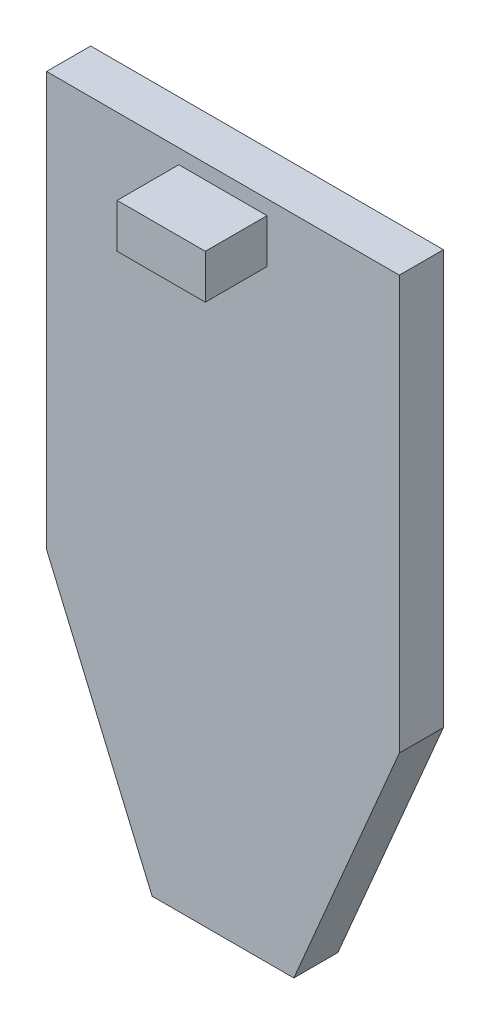
ISO-10303-21;
HEADER;
FILE_DESCRIPTION(('STEP AP214'),'2;1');
FILE_NAME('part.step','',(''),(''),'','','');
FILE_SCHEMA(('AUTOMOTIVE_DESIGN { 1 0 10303 214 1 1 1 1 }'));
ENDSEC;
DATA;
#1=APPLICATION_CONTEXT('core data for automotive mechanical design processes');
#2=APPLICATION_PROTOCOL_DEFINITION('international standard','automotive_design',2000,#1);
#3=PRODUCT_CONTEXT('',#1,'mechanical');
#4=PRODUCT('Part','Part','',(#3));
#5=PRODUCT_RELATED_PRODUCT_CATEGORY('part','',(#4));
#6=PRODUCT_DEFINITION_FORMATION('','',#4);
#7=PRODUCT_DEFINITION_CONTEXT('part definition',#1,'design');
#8=PRODUCT_DEFINITION('design','',#6,#7);
#9=PRODUCT_DEFINITION_SHAPE('','',#8);
#10=(LENGTH_UNIT() NAMED_UNIT(*) SI_UNIT(.MILLI.,.METRE.));
#11=(NAMED_UNIT(*) PLANE_ANGLE_UNIT() SI_UNIT($,.RADIAN.));
#12=(NAMED_UNIT(*) SI_UNIT($,.STERADIAN.) SOLID_ANGLE_UNIT());
#13=UNCERTAINTY_MEASURE_WITH_UNIT(LENGTH_MEASURE(1.E-05),#10,'distance_accuracy_value','');
#14=(GEOMETRIC_REPRESENTATION_CONTEXT(3) GLOBAL_UNCERTAINTY_ASSIGNED_CONTEXT((#13)) GLOBAL_UNIT_ASSIGNED_CONTEXT((#10,
#11,#12)) REPRESENTATION_CONTEXT('',''));
#15=CARTESIAN_POINT('',(0.,0.,0.));
#16=DIRECTION('',(0.,0.,1.));
#17=DIRECTION('',(1.,0.,0.));
#18=AXIS2_PLACEMENT_3D('',#15,#16,#17);
#19=CARTESIAN_POINT('',(0.,0.,1.));
#20=DIRECTION('',(0.,0.,1.));
#21=DIRECTION('',(1.,0.,0.));
#22=AXIS2_PLACEMENT_3D('',#19,#20,#21);
#23=PLANE('',#22);
#24=DIRECTION('',(0.,-1.,0.));
#25=VECTOR('',#24,1.);
#26=CARTESIAN_POINT('',(-4.,6.56277143742668,1.));
#27=LINE('',#26,#25);
#28=CARTESIAN_POINT('',(-4.,6.56277143742668,1.));
#29=VERTEX_POINT('',#28);
#30=CARTESIAN_POINT('',(-4.,-2.82308752313675,1.));
#31=VERTEX_POINT('',#30);
#32=EDGE_CURVE('E143',#29,#31,#27,.T.);
#33=ORIENTED_EDGE('',*,*,#32,.T.);
#34=DIRECTION('',(0.392104932542546,-0.919920497584332,0.));
#35=VECTOR('',#34,1.);
#36=CARTESIAN_POINT('',(-4.,-2.82308752313675,1.));
#37=LINE('',#36,#35);
#38=CARTESIAN_POINT('',(-1.60704060912523,-8.43722856257332,1.));
#39=VERTEX_POINT('',#38);
#40=EDGE_CURVE('E93',#31,#39,#37,.T.);
#41=ORIENTED_EDGE('',*,*,#40,.T.);
#42=DIRECTION('',(1.,0.,0.));
#43=VECTOR('',#42,1.);
#44=CARTESIAN_POINT('',(-1.60704060912523,-8.43722856257332,1.));
#45=LINE('',#44,#43);
#46=CARTESIAN_POINT('',(1.60704060912523,-8.43722856257332,1.));
#47=VERTEX_POINT('',#46);
#48=EDGE_CURVE('E110',#39,#47,#45,.T.);
#49=ORIENTED_EDGE('',*,*,#48,.T.);
#50=DIRECTION('',(0.392104932542546,0.919920497584332,0.));
#51=VECTOR('',#50,1.);
#52=CARTESIAN_POINT('',(4.,-2.82308752313675,1.));
#53=LINE('',#52,#51);
#54=CARTESIAN_POINT('',(4.,-2.82308752313675,1.));
#55=VERTEX_POINT('',#54);
#56=EDGE_CURVE('E103',#47,#55,#53,.T.);
#57=ORIENTED_EDGE('',*,*,#56,.T.);
#58=DIRECTION('',(0.,1.,0.));
#59=VECTOR('',#58,1.);
#60=CARTESIAN_POINT('',(4.,6.56277143742668,1.));
#61=LINE('',#60,#59);
#62=CARTESIAN_POINT('',(4.,6.56277143742668,1.));
#63=VERTEX_POINT('',#62);
#64=EDGE_CURVE('E107',#55,#63,#61,.T.);
#65=ORIENTED_EDGE('',*,*,#64,.T.);
#66=DIRECTION('',(-1.,0.,0.));
#67=VECTOR('',#66,1.);
#68=CARTESIAN_POINT('',(-4.,6.56277143742668,1.));
#69=LINE('',#68,#67);
#70=EDGE_CURVE('E58',#63,#29,#69,.T.);
#71=ORIENTED_EDGE('',*,*,#70,.T.);
#72=EDGE_LOOP('',(#33,#41,#49,#57,#65,#71));
#73=FACE_BOUND('',#72,.T.);
#74=DIRECTION('',(1.,0.,0.));
#75=VECTOR('',#74,1.);
#76=CARTESIAN_POINT('',(-0.999999999999999,5.23117654743256,1.));
#77=LINE('',#76,#75);
#78=CARTESIAN_POINT('',(-0.999999999999999,5.23117654743256,1.));
#79=VERTEX_POINT('',#78);
#80=CARTESIAN_POINT('',(1.,5.23117654743256,1.));
#81=VERTEX_POINT('',#80);
#82=EDGE_CURVE('E175',#79,#81,#77,.T.);
#83=ORIENTED_EDGE('',*,*,#82,.F.);
#84=DIRECTION('',(0.,-1.,0.));
#85=VECTOR('',#84,1.);
#86=CARTESIAN_POINT('',(-1.00000000000001,6.23117654743256,1.));
#87=LINE('',#86,#85);
#88=CARTESIAN_POINT('',(-1.00000000000001,6.23117654743256,1.));
#89=VERTEX_POINT('',#88);
#90=EDGE_CURVE('E178',#89,#79,#87,.T.);
#91=ORIENTED_EDGE('',*,*,#90,.F.);
#92=DIRECTION('',(-1.,0.,0.));
#93=VECTOR('',#92,1.);
#94=CARTESIAN_POINT('',(-1.00000000000001,6.23117654743256,1.));
#95=LINE('',#94,#93);
#96=CARTESIAN_POINT('',(1.,6.23117654743256,1.));
#97=VERTEX_POINT('',#96);
#98=EDGE_CURVE('E170',#97,#89,#95,.T.);
#99=ORIENTED_EDGE('',*,*,#98,.F.);
#100=DIRECTION('',(0.,1.,0.));
#101=VECTOR('',#100,1.);
#102=CARTESIAN_POINT('',(1.,6.23117654743256,1.));
#103=LINE('',#102,#101);
#104=EDGE_CURVE('E173',#81,#97,#103,.T.);
#105=ORIENTED_EDGE('',*,*,#104,.F.);
#106=EDGE_LOOP('',(#83,#91,#99,#105));
#107=FACE_BOUND('',#106,.T.);
#108=ADVANCED_FACE('F34',(#73,#107),#23,.T.);
#109=CARTESIAN_POINT('',(-4.,6.56277143742668,1.));
#110=DIRECTION('',(1.,0.,0.));
#111=DIRECTION('',(0.,1.,0.));
#112=AXIS2_PLACEMENT_3D('',#109,#110,#111);
#113=PLANE('',#112);
#114=DIRECTION('',(0.,-1.,0.));
#115=VECTOR('',#114,1.);
#116=CARTESIAN_POINT('',(-4.,6.56277143742668,0.));
#117=LINE('',#116,#115);
#118=CARTESIAN_POINT('',(-4.,6.56277143742668,0.));
#119=VERTEX_POINT('',#118);
#120=CARTESIAN_POINT('',(-4.,-2.82308752313675,0.));
#121=VERTEX_POINT('',#120);
#122=EDGE_CURVE('E131',#119,#121,#117,.T.);
#123=ORIENTED_EDGE('',*,*,#122,.T.);
#124=DIRECTION('',(0.,0.,-1.));
#125=VECTOR('',#124,1.);
#126=CARTESIAN_POINT('',(-4.,-2.82308752313675,1.));
#127=LINE('',#126,#125);
#128=EDGE_CURVE('E11',#31,#121,#127,.T.);
#129=ORIENTED_EDGE('',*,*,#128,.F.);
#130=ORIENTED_EDGE('',*,*,#32,.F.);
#131=DIRECTION('',(0.,0.,-1.));
#132=VECTOR('',#131,1.);
#133=CARTESIAN_POINT('',(-4.,6.56277143742668,1.));
#134=LINE('',#133,#132);
#135=EDGE_CURVE('E127',#29,#119,#134,.T.);
#136=ORIENTED_EDGE('',*,*,#135,.T.);
#137=EDGE_LOOP('',(#123,#129,#130,#136));
#138=FACE_BOUND('',#137,.T.);
#139=ADVANCED_FACE('F36',(#138),#113,.F.);
#140=CARTESIAN_POINT('',(-4.,-2.82308752313675,1.));
#141=DIRECTION('',(0.919920497584332,0.392104932542546,0.));
#142=DIRECTION('',(-0.392104932542546,0.919920497584332,0.));
#143=AXIS2_PLACEMENT_3D('',#140,#141,#142);
#144=PLANE('',#143);
#145=DIRECTION('',(0.392104932542546,-0.919920497584332,0.));
#146=VECTOR('',#145,1.);
#147=CARTESIAN_POINT('',(-4.,-2.82308752313675,0.));
#148=LINE('',#147,#146);
#149=CARTESIAN_POINT('',(-1.60704060912523,-8.43722856257332,0.));
#150=VERTEX_POINT('',#149);
#151=EDGE_CURVE('E134',#121,#150,#148,.T.);
#152=ORIENTED_EDGE('',*,*,#151,.T.);
#153=DIRECTION('',(0.,0.,-1.));
#154=VECTOR('',#153,1.);
#155=CARTESIAN_POINT('',(-1.60704060912523,-8.43722856257332,1.));
#156=LINE('',#155,#154);
#157=EDGE_CURVE('E42',#39,#150,#156,.T.);
#158=ORIENTED_EDGE('',*,*,#157,.F.);
#159=ORIENTED_EDGE('',*,*,#40,.F.);
#160=ORIENTED_EDGE('',*,*,#128,.T.);
#161=EDGE_LOOP('',(#152,#158,#159,#160));
#162=FACE_BOUND('',#161,.T.);
#163=ADVANCED_FACE('F224',(#162),#144,.F.);
#164=CARTESIAN_POINT('',(-1.60704060912523,-8.43722856257332,1.));
#165=DIRECTION('',(0.,1.,0.));
#166=DIRECTION('',(0.,0.,1.));
#167=AXIS2_PLACEMENT_3D('',#164,#165,#166);
#168=PLANE('',#167);
#169=DIRECTION('',(1.,0.,0.));
#170=VECTOR('',#169,1.);
#171=CARTESIAN_POINT('',(-1.60704060912523,-8.43722856257332,0.));
#172=LINE('',#171,#170);
#173=CARTESIAN_POINT('',(1.60704060912523,-8.43722856257332,0.));
#174=VERTEX_POINT('',#173);
#175=EDGE_CURVE('E137',#150,#174,#172,.T.);
#176=ORIENTED_EDGE('',*,*,#175,.T.);
#177=DIRECTION('',(0.,0.,-1.));
#178=VECTOR('',#177,1.);
#179=CARTESIAN_POINT('',(1.60704060912523,-8.43722856257332,1.));
#180=LINE('',#179,#178);
#181=EDGE_CURVE('E122',#47,#174,#180,.T.);
#182=ORIENTED_EDGE('',*,*,#181,.F.);
#183=ORIENTED_EDGE('',*,*,#48,.F.);
#184=ORIENTED_EDGE('',*,*,#157,.T.);
#185=EDGE_LOOP('',(#176,#182,#183,#184));
#186=FACE_BOUND('',#185,.T.);
#187=ADVANCED_FACE('F149',(#186),#168,.F.);
#188=CARTESIAN_POINT('',(4.,-2.82308752313675,1.));
#189=DIRECTION('',(-0.919920497584332,0.392104932542546,0.));
#190=DIRECTION('',(-0.392104932542546,-0.919920497584332,0.));
#191=AXIS2_PLACEMENT_3D('',#188,#189,#190);
#192=PLANE('',#191);
#193=DIRECTION('',(0.392104932542546,0.919920497584332,0.));
#194=VECTOR('',#193,1.);
#195=CARTESIAN_POINT('',(4.,-2.82308752313675,0.));
#196=LINE('',#195,#194);
#197=CARTESIAN_POINT('',(4.,-2.82308752313675,0.));
#198=VERTEX_POINT('',#197);
#199=EDGE_CURVE('E119',#174,#198,#196,.T.);
#200=ORIENTED_EDGE('',*,*,#199,.T.);
#201=DIRECTION('',(0.,0.,-1.));
#202=VECTOR('',#201,1.);
#203=CARTESIAN_POINT('',(4.,-2.82308752313675,1.));
#204=LINE('',#203,#202);
#205=EDGE_CURVE('E116',#55,#198,#204,.T.);
#206=ORIENTED_EDGE('',*,*,#205,.F.);
#207=ORIENTED_EDGE('',*,*,#56,.F.);
#208=ORIENTED_EDGE('',*,*,#181,.T.);
#209=EDGE_LOOP('',(#200,#206,#207,#208));
#210=FACE_BOUND('',#209,.T.);
#211=ADVANCED_FACE('F117',(#210),#192,.F.);
#212=CARTESIAN_POINT('',(4.,6.56277143742668,1.));
#213=DIRECTION('',(-1.,0.,0.));
#214=DIRECTION('',(0.,-1.,0.));
#215=AXIS2_PLACEMENT_3D('',#212,#213,#214);
#216=PLANE('',#215);
#217=DIRECTION('',(0.,1.,0.));
#218=VECTOR('',#217,1.);
#219=CARTESIAN_POINT('',(4.,6.56277143742668,0.));
#220=LINE('',#219,#218);
#221=CARTESIAN_POINT('',(4.,6.56277143742668,0.));
#222=VERTEX_POINT('',#221);
#223=EDGE_CURVE('E140',#198,#222,#220,.T.);
#224=ORIENTED_EDGE('',*,*,#223,.T.);
#225=DIRECTION('',(0.,0.,-1.));
#226=VECTOR('',#225,1.);
#227=CARTESIAN_POINT('',(4.,6.56277143742668,1.));
#228=LINE('',#227,#226);
#229=EDGE_CURVE('E123',#63,#222,#228,.T.);
#230=ORIENTED_EDGE('',*,*,#229,.F.);
#231=ORIENTED_EDGE('',*,*,#64,.F.);
#232=ORIENTED_EDGE('',*,*,#205,.T.);
#233=EDGE_LOOP('',(#224,#230,#231,#232));
#234=FACE_BOUND('',#233,.T.);
#235=ADVANCED_FACE('F125',(#234),#216,.F.);
#236=CARTESIAN_POINT('',(-4.,6.56277143742668,1.));
#237=DIRECTION('',(0.,-1.,0.));
#238=DIRECTION('',(1.,0.,0.));
#239=AXIS2_PLACEMENT_3D('',#236,#237,#238);
#240=PLANE('',#239);
#241=DIRECTION('',(-1.,0.,0.));
#242=VECTOR('',#241,1.);
#243=CARTESIAN_POINT('',(-4.,6.56277143742668,0.));
#244=LINE('',#243,#242);
#245=EDGE_CURVE('E85',#222,#119,#244,.T.);
#246=ORIENTED_EDGE('',*,*,#245,.T.);
#247=ORIENTED_EDGE('',*,*,#135,.F.);
#248=ORIENTED_EDGE('',*,*,#70,.F.);
#249=ORIENTED_EDGE('',*,*,#229,.T.);
#250=EDGE_LOOP('',(#246,#247,#248,#249));
#251=FACE_BOUND('',#250,.T.);
#252=ADVANCED_FACE('F153',(#251),#240,.F.);
#253=CARTESIAN_POINT('',(0.,0.,0.));
#254=DIRECTION('',(0.,0.,1.));
#255=DIRECTION('',(1.,0.,0.));
#256=AXIS2_PLACEMENT_3D('',#253,#254,#255);
#257=PLANE('',#256);
#258=ORIENTED_EDGE('',*,*,#122,.F.);
#259=ORIENTED_EDGE('',*,*,#245,.F.);
#260=ORIENTED_EDGE('',*,*,#223,.F.);
#261=ORIENTED_EDGE('',*,*,#199,.F.);
#262=ORIENTED_EDGE('',*,*,#175,.F.);
#263=ORIENTED_EDGE('',*,*,#151,.F.);
#264=EDGE_LOOP('',(#258,#259,#260,#261,#262,#263));
#265=FACE_BOUND('',#264,.T.);
#266=ADVANCED_FACE('F152',(#265),#257,.F.);
#267=CARTESIAN_POINT('',(-1.00000000000001,6.23117654743256,2.4));
#268=DIRECTION('',(1.,0.,0.));
#269=DIRECTION('',(0.,1.,0.));
#270=AXIS2_PLACEMENT_3D('',#267,#268,#269);
#271=PLANE('',#270);
#272=ORIENTED_EDGE('',*,*,#90,.T.);
#273=DIRECTION('',(0.,0.,-1.));
#274=VECTOR('',#273,1.);
#275=CARTESIAN_POINT('',(-0.999999999999999,5.23117654743256,2.4));
#276=LINE('',#275,#274);
#277=CARTESIAN_POINT('',(-0.999999999999999,5.23117654743256,2.4));
#278=VERTEX_POINT('',#277);
#279=EDGE_CURVE('E135',#278,#79,#276,.T.);
#280=ORIENTED_EDGE('',*,*,#279,.F.);
#281=DIRECTION('',(0.,-1.,0.));
#282=VECTOR('',#281,1.);
#283=CARTESIAN_POINT('',(-1.00000000000001,6.23117654743256,2.4));
#284=LINE('',#283,#282);
#285=CARTESIAN_POINT('',(-1.00000000000001,6.23117654743256,2.4));
#286=VERTEX_POINT('',#285);
#287=EDGE_CURVE('E172',#286,#278,#284,.T.);
#288=ORIENTED_EDGE('',*,*,#287,.F.);
#289=DIRECTION('',(0.,0.,-1.));
#290=VECTOR('',#289,1.);
#291=CARTESIAN_POINT('',(-1.00000000000001,6.23117654743256,2.4));
#292=LINE('',#291,#290);
#293=EDGE_CURVE('E166',#286,#89,#292,.T.);
#294=ORIENTED_EDGE('',*,*,#293,.T.);
#295=EDGE_LOOP('',(#272,#280,#288,#294));
#296=FACE_BOUND('',#295,.T.);
#297=ADVANCED_FACE('F201',(#296),#271,.F.);
#298=CARTESIAN_POINT('',(-0.999999999999999,5.23117654743256,2.4));
#299=DIRECTION('',(0.,1.,0.));
#300=DIRECTION('',(0.,0.,1.));
#301=AXIS2_PLACEMENT_3D('',#298,#299,#300);
#302=PLANE('',#301);
#303=ORIENTED_EDGE('',*,*,#82,.T.);
#304=DIRECTION('',(0.,0.,-1.));
#305=VECTOR('',#304,1.);
#306=CARTESIAN_POINT('',(1.,5.23117654743256,2.4));
#307=LINE('',#306,#305);
#308=CARTESIAN_POINT('',(1.,5.23117654743256,2.4));
#309=VERTEX_POINT('',#308);
#310=EDGE_CURVE('E162',#309,#81,#307,.T.);
#311=ORIENTED_EDGE('',*,*,#310,.F.);
#312=DIRECTION('',(1.,0.,0.));
#313=VECTOR('',#312,1.);
#314=CARTESIAN_POINT('',(-0.999999999999999,5.23117654743256,2.4));
#315=LINE('',#314,#313);
#316=EDGE_CURVE('E186',#278,#309,#315,.T.);
#317=ORIENTED_EDGE('',*,*,#316,.F.);
#318=ORIENTED_EDGE('',*,*,#279,.T.);
#319=EDGE_LOOP('',(#303,#311,#317,#318));
#320=FACE_BOUND('',#319,.T.);
#321=ADVANCED_FACE('F206',(#320),#302,.F.);
#322=CARTESIAN_POINT('',(1.,6.23117654743256,2.4));
#323=DIRECTION('',(-1.,0.,0.));
#324=DIRECTION('',(0.,0.,1.));
#325=AXIS2_PLACEMENT_3D('',#322,#323,#324);
#326=PLANE('',#325);
#327=ORIENTED_EDGE('',*,*,#104,.T.);
#328=DIRECTION('',(0.,0.,-1.));
#329=VECTOR('',#328,1.);
#330=CARTESIAN_POINT('',(1.,6.23117654743256,2.4));
#331=LINE('',#330,#329);
#332=CARTESIAN_POINT('',(1.,6.23117654743256,2.4));
#333=VERTEX_POINT('',#332);
#334=EDGE_CURVE('E49',#333,#97,#331,.T.);
#335=ORIENTED_EDGE('',*,*,#334,.F.);
#336=DIRECTION('',(0.,1.,0.));
#337=VECTOR('',#336,1.);
#338=CARTESIAN_POINT('',(1.,6.23117654743256,2.4));
#339=LINE('',#338,#337);
#340=EDGE_CURVE('E183',#309,#333,#339,.T.);
#341=ORIENTED_EDGE('',*,*,#340,.F.);
#342=ORIENTED_EDGE('',*,*,#310,.T.);
#343=EDGE_LOOP('',(#327,#335,#341,#342));
#344=FACE_BOUND('',#343,.T.);
#345=ADVANCED_FACE('F215',(#344),#326,.F.);
#346=CARTESIAN_POINT('',(-1.00000000000001,6.23117654743256,2.4));
#347=DIRECTION('',(0.,-1.,0.));
#348=DIRECTION('',(0.,0.,-1.));
#349=AXIS2_PLACEMENT_3D('',#346,#347,#348);
#350=PLANE('',#349);
#351=ORIENTED_EDGE('',*,*,#98,.T.);
#352=ORIENTED_EDGE('',*,*,#293,.F.);
#353=DIRECTION('',(-1.,0.,0.));
#354=VECTOR('',#353,1.);
#355=CARTESIAN_POINT('',(-1.00000000000001,6.23117654743256,2.4));
#356=LINE('',#355,#354);
#357=EDGE_CURVE('E169',#333,#286,#356,.T.);
#358=ORIENTED_EDGE('',*,*,#357,.F.);
#359=ORIENTED_EDGE('',*,*,#334,.T.);
#360=EDGE_LOOP('',(#351,#352,#358,#359));
#361=FACE_BOUND('',#360,.T.);
#362=ADVANCED_FACE('F218',(#361),#350,.F.);
#363=CARTESIAN_POINT('',(0.,0.,2.4));
#364=DIRECTION('',(0.,0.,1.));
#365=DIRECTION('',(1.,0.,0.));
#366=AXIS2_PLACEMENT_3D('',#363,#364,#365);
#367=PLANE('',#366);
#368=ORIENTED_EDGE('',*,*,#287,.T.);
#369=ORIENTED_EDGE('',*,*,#316,.T.);
#370=ORIENTED_EDGE('',*,*,#340,.T.);
#371=ORIENTED_EDGE('',*,*,#357,.T.);
#372=EDGE_LOOP('',(#368,#369,#370,#371));
#373=FACE_BOUND('',#372,.T.);
#374=ADVANCED_FACE('F194',(#373),#367,.T.);
#375=CLOSED_SHELL('',(#108,#139,#163,#187,#211,#235,#252,#266,#297,#321,#345,#362,#374));
#376=MANIFOLD_SOLID_BREP('B2',#375);
#377=ADVANCED_BREP_SHAPE_REPRESENTATION('',(#18,#376),#14);
#378=SHAPE_DEFINITION_REPRESENTATION(#9,#377);
ENDSEC;
END-ISO-10303-21;
